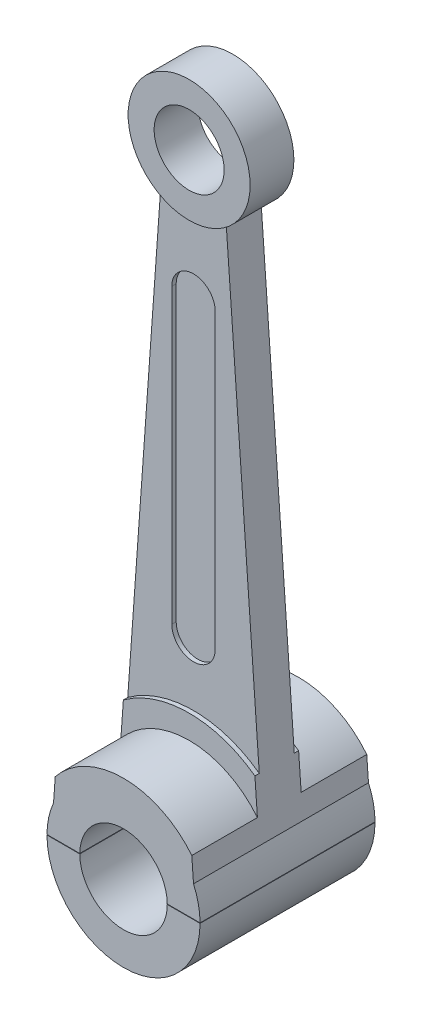
ISO-10303-21;
HEADER;
FILE_DESCRIPTION(('STEP AP214'),'2;1');
FILE_NAME('part.step','',(''),(''),'','','');
FILE_SCHEMA(('AUTOMOTIVE_DESIGN { 1 0 10303 214 1 1 1 1 }'));
ENDSEC;
DATA;
#1=APPLICATION_CONTEXT('core data for automotive mechanical design processes');
#2=APPLICATION_PROTOCOL_DEFINITION('international standard','automotive_design',2000,#1);
#3=PRODUCT_CONTEXT('',#1,'mechanical');
#4=PRODUCT('Part','Part','',(#3));
#5=PRODUCT_RELATED_PRODUCT_CATEGORY('part','',(#4));
#6=PRODUCT_DEFINITION_FORMATION('','',#4);
#7=PRODUCT_DEFINITION_CONTEXT('part definition',#1,'design');
#8=PRODUCT_DEFINITION('design','',#6,#7);
#9=PRODUCT_DEFINITION_SHAPE('','',#8);
#10=(LENGTH_UNIT() NAMED_UNIT(*) SI_UNIT(.MILLI.,.METRE.));
#11=(NAMED_UNIT(*) PLANE_ANGLE_UNIT() SI_UNIT($,.RADIAN.));
#12=(NAMED_UNIT(*) SI_UNIT($,.STERADIAN.) SOLID_ANGLE_UNIT());
#13=UNCERTAINTY_MEASURE_WITH_UNIT(LENGTH_MEASURE(1.E-05),#10,'distance_accuracy_value','');
#14=(GEOMETRIC_REPRESENTATION_CONTEXT(3) GLOBAL_UNCERTAINTY_ASSIGNED_CONTEXT((#13)) GLOBAL_UNIT_ASSIGNED_CONTEXT((#10,
#11,#12)) REPRESENTATION_CONTEXT('',''));
#15=CARTESIAN_POINT('',(0.,0.,0.));
#16=DIRECTION('',(0.,0.,1.));
#17=DIRECTION('',(1.,0.,0.));
#18=AXIS2_PLACEMENT_3D('',#15,#16,#17);
#19=CARTESIAN_POINT('',(0.,0.,-15.75));
#20=DIRECTION('',(0.,0.,1.));
#21=DIRECTION('',(1.,0.,0.));
#22=AXIS2_PLACEMENT_3D('',#19,#20,#21);
#23=CYLINDRICAL_SURFACE('',#22,1.75);
#24=CARTESIAN_POINT('',(0.,0.,-2.));
#25=DIRECTION('',(0.,0.,1.));
#26=DIRECTION('',(1.,0.,0.));
#27=AXIS2_PLACEMENT_3D('',#24,#25,#26);
#28=CIRCLE('',#27,1.75);
#29=CARTESIAN_POINT('',(-1.74997142833819,0.00999999999999898,-2.));
#30=VERTEX_POINT('',#29);
#31=CARTESIAN_POINT('',(-1.6,0.708872343937891,-2.));
#32=VERTEX_POINT('',#31);
#33=EDGE_CURVE('E264',#30,#32,#28,.F.);
#34=ORIENTED_EDGE('',*,*,#33,.F.);
#35=DIRECTION('',(0.,0.,1.));
#36=VECTOR('',#35,1.);
#37=CARTESIAN_POINT('',(-1.74997142833819,0.00999999999999898,-15.75));
#38=LINE('',#37,#36);
#39=CARTESIAN_POINT('',(-1.74997142833819,0.00999999999999898,2.));
#40=VERTEX_POINT('',#39);
#41=EDGE_CURVE('E299',#30,#40,#38,.T.);
#42=ORIENTED_EDGE('',*,*,#41,.T.);
#43=CARTESIAN_POINT('',(0.,0.,2.));
#44=DIRECTION('',(0.,0.,1.));
#45=DIRECTION('',(1.,0.,0.));
#46=AXIS2_PLACEMENT_3D('',#43,#44,#45);
#47=CIRCLE('',#46,1.75);
#48=CARTESIAN_POINT('',(-1.6,0.708872343937891,2.));
#49=VERTEX_POINT('',#48);
#50=EDGE_CURVE('E252',#40,#49,#47,.F.);
#51=ORIENTED_EDGE('',*,*,#50,.T.);
#52=DIRECTION('',(0.,0.,1.));
#53=VECTOR('',#52,1.);
#54=CARTESIAN_POINT('',(-1.6,0.708872343937891,-15.75));
#55=LINE('',#54,#53);
#56=EDGE_CURVE('E262',#32,#49,#55,.T.);
#57=ORIENTED_EDGE('',*,*,#56,.F.);
#58=EDGE_LOOP('',(#34,#42,#51,#57));
#59=FACE_BOUND('',#58,.T.);
#60=ADVANCED_FACE('F45',(#59),#23,.T.);
#61=CARTESIAN_POINT('',(0.,0.,0.5));
#62=DIRECTION('',(0.,0.,-1.));
#63=DIRECTION('',(-1.,0.,0.));
#64=AXIS2_PLACEMENT_3D('',#61,#62,#63);
#65=CYLINDRICAL_SURFACE('',#64,2.54);
#66=CARTESIAN_POINT('',(0.,0.,0.5));
#67=DIRECTION('',(0.,0.,1.));
#68=DIRECTION('',(1.,0.,0.));
#69=AXIS2_PLACEMENT_3D('',#66,#67,#68);
#70=CIRCLE('',#69,2.54);
#71=CARTESIAN_POINT('',(1.5036414370813,2.04711075144753,0.5));
#72=VERTEX_POINT('',#71);
#73=CARTESIAN_POINT('',(-1.5036414370813,2.04711075144753,0.5));
#74=VERTEX_POINT('',#73);
#75=EDGE_CURVE('E187',#72,#74,#70,.T.);
#76=ORIENTED_EDGE('',*,*,#75,.F.);
#77=DIRECTION('',(0.,0.,-1.));
#78=VECTOR('',#77,1.);
#79=CARTESIAN_POINT('',(1.5036414370813,2.04711075144753,0.5));
#80=LINE('',#79,#78);
#81=CARTESIAN_POINT('',(1.5036414370813,2.04711075144753,0.4));
#82=VERTEX_POINT('',#81);
#83=EDGE_CURVE('E249',#72,#82,#80,.T.);
#84=ORIENTED_EDGE('',*,*,#83,.T.);
#85=CARTESIAN_POINT('',(0.,0.,0.4));
#86=DIRECTION('',(0.,0.,1.));
#87=DIRECTION('',(1.,0.,0.));
#88=AXIS2_PLACEMENT_3D('',#85,#86,#87);
#89=CIRCLE('',#88,2.54);
#90=CARTESIAN_POINT('',(-1.5036414370813,2.04711075144753,0.4));
#91=VERTEX_POINT('',#90);
#92=EDGE_CURVE('E162',#82,#91,#89,.T.);
#93=ORIENTED_EDGE('',*,*,#92,.T.);
#94=DIRECTION('',(0.,0.,-1.));
#95=VECTOR('',#94,1.);
#96=CARTESIAN_POINT('',(-1.5036414370813,2.04711075144753,0.5));
#97=LINE('',#96,#95);
#98=EDGE_CURVE('E129',#91,#74,#97,.F.);
#99=ORIENTED_EDGE('',*,*,#98,.T.);
#100=EDGE_LOOP('',(#76,#84,#93,#99));
#101=FACE_BOUND('',#100,.T.);
#102=ADVANCED_FACE('F451',(#101),#65,.T.);
#103=CARTESIAN_POINT('',(0.,4.,0.4));
#104=DIRECTION('',(0.,0.,-1.));
#105=DIRECTION('',(-1.,0.,0.));
#106=AXIS2_PLACEMENT_3D('',#103,#104,#105);
#107=CYLINDRICAL_SURFACE('',#106,0.496250448401979);
#108=DIRECTION('',(0.,0.,-1.));
#109=VECTOR('',#108,1.);
#110=CARTESIAN_POINT('',(-0.496250448401978,4.,0.4));
#111=LINE('',#110,#109);
#112=CARTESIAN_POINT('',(-0.496250448401978,4.,-0.3));
#113=VERTEX_POINT('',#112);
#114=CARTESIAN_POINT('',(-0.496250448401978,4.,-0.4));
#115=VERTEX_POINT('',#114);
#116=EDGE_CURVE('E195',#113,#115,#111,.T.);
#117=ORIENTED_EDGE('',*,*,#116,.F.);
#118=CARTESIAN_POINT('',(0.,4.,-0.3));
#119=DIRECTION('',(0.,0.,1.));
#120=DIRECTION('',(1.,0.,0.));
#121=AXIS2_PLACEMENT_3D('',#118,#119,#120);
#122=CIRCLE('',#121,0.496250448401979);
#123=CARTESIAN_POINT('',(0.49625044840198,4.,-0.3));
#124=VERTEX_POINT('',#123);
#125=EDGE_CURVE('E201',#113,#124,#122,.T.);
#126=ORIENTED_EDGE('',*,*,#125,.T.);
#127=DIRECTION('',(0.,0.,-1.));
#128=VECTOR('',#127,1.);
#129=CARTESIAN_POINT('',(0.49625044840198,4.,0.4));
#130=LINE('',#129,#128);
#131=CARTESIAN_POINT('',(0.49625044840198,4.,-0.4));
#132=VERTEX_POINT('',#131);
#133=EDGE_CURVE('E204',#124,#132,#130,.T.);
#134=ORIENTED_EDGE('',*,*,#133,.T.);
#135=CARTESIAN_POINT('',(0.,4.,-0.4));
#136=DIRECTION('',(0.,0.,1.));
#137=DIRECTION('',(1.,0.,0.));
#138=AXIS2_PLACEMENT_3D('',#135,#136,#137);
#139=CIRCLE('',#138,0.496250448401979);
#140=EDGE_CURVE('E167',#115,#132,#139,.T.);
#141=ORIENTED_EDGE('',*,*,#140,.F.);
#142=EDGE_LOOP('',(#117,#126,#134,#141));
#143=FACE_BOUND('',#142,.T.);
#144=ADVANCED_FACE('F356',(#143),#107,.F.);
#145=CARTESIAN_POINT('',(-0.496250448401977,0.,0.4));
#146=DIRECTION('',(1.,0.,0.));
#147=DIRECTION('',(0.,1.,0.));
#148=AXIS2_PLACEMENT_3D('',#145,#146,#147);
#149=PLANE('',#148);
#150=DIRECTION('',(0.,0.,-1.));
#151=VECTOR('',#150,1.);
#152=CARTESIAN_POINT('',(-0.496250448401979,10.69,0.4));
#153=LINE('',#152,#151);
#154=CARTESIAN_POINT('',(-0.496250448401979,10.69,-0.3));
#155=VERTEX_POINT('',#154);
#156=CARTESIAN_POINT('',(-0.496250448401979,10.69,-0.4));
#157=VERTEX_POINT('',#156);
#158=EDGE_CURVE('E194',#155,#157,#153,.T.);
#159=ORIENTED_EDGE('',*,*,#158,.F.);
#160=DIRECTION('',(0.,-1.,0.));
#161=VECTOR('',#160,1.);
#162=CARTESIAN_POINT('',(-0.496250448401977,0.,-0.3));
#163=LINE('',#162,#161);
#164=EDGE_CURVE('E205',#155,#113,#163,.T.);
#165=ORIENTED_EDGE('',*,*,#164,.T.);
#166=ORIENTED_EDGE('',*,*,#116,.T.);
#167=DIRECTION('',(0.,-1.,0.));
#168=VECTOR('',#167,1.);
#169=CARTESIAN_POINT('',(-0.496250448401977,0.,-0.4));
#170=LINE('',#169,#168);
#171=EDGE_CURVE('E333',#157,#115,#170,.T.);
#172=ORIENTED_EDGE('',*,*,#171,.F.);
#173=EDGE_LOOP('',(#159,#165,#166,#172));
#174=FACE_BOUND('',#173,.T.);
#175=ADVANCED_FACE('F458',(#174),#149,.T.);
#176=CARTESIAN_POINT('',(0.,10.69,0.4));
#177=DIRECTION('',(0.,0.,-1.));
#178=DIRECTION('',(-1.,0.,0.));
#179=AXIS2_PLACEMENT_3D('',#176,#177,#178);
#180=CYLINDRICAL_SURFACE('',#179,0.496250448401979);
#181=DIRECTION('',(0.,0.,-1.));
#182=VECTOR('',#181,1.);
#183=CARTESIAN_POINT('',(0.496250448401979,10.69,0.4));
#184=LINE('',#183,#182);
#185=CARTESIAN_POINT('',(0.496250448401979,10.69,-0.3));
#186=VERTEX_POINT('',#185);
#187=CARTESIAN_POINT('',(0.496250448401979,10.69,-0.4));
#188=VERTEX_POINT('',#187);
#189=EDGE_CURVE('E327',#186,#188,#184,.T.);
#190=ORIENTED_EDGE('',*,*,#189,.F.);
#191=CARTESIAN_POINT('',(0.,10.69,-0.3));
#192=DIRECTION('',(0.,0.,1.));
#193=DIRECTION('',(1.,0.,0.));
#194=AXIS2_PLACEMENT_3D('',#191,#192,#193);
#195=CIRCLE('',#194,0.496250448401979);
#196=EDGE_CURVE('E191',#186,#155,#195,.T.);
#197=ORIENTED_EDGE('',*,*,#196,.T.);
#198=ORIENTED_EDGE('',*,*,#158,.T.);
#199=CARTESIAN_POINT('',(0.,10.69,-0.4));
#200=DIRECTION('',(0.,0.,1.));
#201=DIRECTION('',(1.,0.,0.));
#202=AXIS2_PLACEMENT_3D('',#199,#200,#201);
#203=CIRCLE('',#202,0.496250448401979);
#204=EDGE_CURVE('E336',#188,#157,#203,.T.);
#205=ORIENTED_EDGE('',*,*,#204,.F.);
#206=EDGE_LOOP('',(#190,#197,#198,#205));
#207=FACE_BOUND('',#206,.T.);
#208=ADVANCED_FACE('F485',(#207),#180,.F.);
#209=CARTESIAN_POINT('',(0.49625044840198,0.,0.4));
#210=DIRECTION('',(1.,0.,0.));
#211=DIRECTION('',(0.,1.,0.));
#212=AXIS2_PLACEMENT_3D('',#209,#210,#211);
#213=PLANE('',#212);
#214=DIRECTION('',(0.,-1.,0.));
#215=VECTOR('',#214,1.);
#216=CARTESIAN_POINT('',(0.49625044840198,0.,-0.3));
#217=LINE('',#216,#215);
#218=EDGE_CURVE('E196',#186,#124,#217,.T.);
#219=ORIENTED_EDGE('',*,*,#218,.F.);
#220=ORIENTED_EDGE('',*,*,#189,.T.);
#221=DIRECTION('',(0.,-1.,0.));
#222=VECTOR('',#221,1.);
#223=CARTESIAN_POINT('',(0.49625044840198,0.,-0.4));
#224=LINE('',#223,#222);
#225=EDGE_CURVE('E158',#188,#132,#224,.T.);
#226=ORIENTED_EDGE('',*,*,#225,.T.);
#227=ORIENTED_EDGE('',*,*,#133,.F.);
#228=EDGE_LOOP('',(#219,#220,#226,#227));
#229=FACE_BOUND('',#228,.T.);
#230=ADVANCED_FACE('F480',(#229),#213,.F.);
#231=CARTESIAN_POINT('',(0.,13.69,0.5));
#232=DIRECTION('',(0.,0.,-1.));
#233=DIRECTION('',(-1.,0.,0.));
#234=AXIS2_PLACEMENT_3D('',#231,#232,#233);
#235=CYLINDRICAL_SURFACE('',#234,0.8);
#236=CARTESIAN_POINT('',(0.,13.69,0.5));
#237=DIRECTION('',(0.,0.,1.));
#238=DIRECTION('',(1.,0.,0.));
#239=AXIS2_PLACEMENT_3D('',#236,#237,#238);
#240=CIRCLE('',#239,0.8);
#241=CARTESIAN_POINT('',(0.8,13.69,0.5));
#242=VERTEX_POINT('',#241);
#243=EDGE_CURVE('E153',#242,#242,#240,.T.);
#244=ORIENTED_EDGE('',*,*,#243,.T.);
#245=EDGE_LOOP('',(#244));
#246=FACE_BOUND('',#245,.T.);
#247=CARTESIAN_POINT('',(0.,13.69,-0.5));
#248=DIRECTION('',(0.,0.,1.));
#249=DIRECTION('',(1.,0.,0.));
#250=AXIS2_PLACEMENT_3D('',#247,#248,#249);
#251=CIRCLE('',#250,0.8);
#252=CARTESIAN_POINT('',(0.8,13.69,-0.5));
#253=VERTEX_POINT('',#252);
#254=EDGE_CURVE('E181',#253,#253,#251,.T.);
#255=ORIENTED_EDGE('',*,*,#254,.F.);
#256=EDGE_LOOP('',(#255));
#257=FACE_BOUND('',#256,.T.);
#258=ADVANCED_FACE('F501',(#246,#257),#235,.F.);
#259=CARTESIAN_POINT('',(0.,13.69,0.5));
#260=DIRECTION('',(0.,0.,-1.));
#261=DIRECTION('',(-1.,0.,0.));
#262=AXIS2_PLACEMENT_3D('',#259,#260,#261);
#263=CYLINDRICAL_SURFACE('',#262,1.395);
#264=CARTESIAN_POINT('',(0.,13.69,0.4));
#265=DIRECTION('',(0.,0.,1.));
#266=DIRECTION('',(1.,0.,0.));
#267=AXIS2_PLACEMENT_3D('',#264,#265,#266);
#268=CIRCLE('',#267,1.395);
#269=CARTESIAN_POINT('',(-0.75,12.5137666047931,0.400000000000001));
#270=VERTEX_POINT('',#269);
#271=CARTESIAN_POINT('',(0.75,12.5137666047931,0.400000000000001));
#272=VERTEX_POINT('',#271);
#273=EDGE_CURVE('E143',#270,#272,#268,.T.);
#274=ORIENTED_EDGE('',*,*,#273,.T.);
#275=DIRECTION('',(0.,0.,-1.));
#276=VECTOR('',#275,1.);
#277=CARTESIAN_POINT('',(0.75,12.5137666047931,0.4));
#278=LINE('',#277,#276);
#279=CARTESIAN_POINT('',(0.75,12.5137666047931,-0.399999999999999));
#280=VERTEX_POINT('',#279);
#281=EDGE_CURVE('E152',#272,#280,#278,.T.);
#282=ORIENTED_EDGE('',*,*,#281,.T.);
#283=CARTESIAN_POINT('',(0.,13.69,-0.4));
#284=DIRECTION('',(0.,0.,1.));
#285=DIRECTION('',(1.,0.,0.));
#286=AXIS2_PLACEMENT_3D('',#283,#284,#285);
#287=CIRCLE('',#286,1.395);
#288=CARTESIAN_POINT('',(-0.75,12.5137666047931,-0.399999999999999));
#289=VERTEX_POINT('',#288);
#290=EDGE_CURVE('E145',#289,#280,#287,.T.);
#291=ORIENTED_EDGE('',*,*,#290,.F.);
#292=DIRECTION('',(0.,0.,-1.));
#293=VECTOR('',#292,1.);
#294=CARTESIAN_POINT('',(-0.75,12.5137666047931,0.4));
#295=LINE('',#294,#293);
#296=EDGE_CURVE('E127',#270,#289,#295,.T.);
#297=ORIENTED_EDGE('',*,*,#296,.F.);
#298=EDGE_LOOP('',(#274,#282,#291,#297));
#299=FACE_BOUND('',#298,.T.);
#300=CARTESIAN_POINT('',(0.,13.69,-0.5));
#301=DIRECTION('',(0.,0.,1.));
#302=DIRECTION('',(1.,0.,0.));
#303=AXIS2_PLACEMENT_3D('',#300,#301,#302);
#304=CIRCLE('',#303,1.395);
#305=CARTESIAN_POINT('',(1.395,13.69,-0.5));
#306=VERTEX_POINT('',#305);
#307=EDGE_CURVE('E155',#306,#306,#304,.T.);
#308=ORIENTED_EDGE('',*,*,#307,.T.);
#309=EDGE_LOOP('',(#308));
#310=FACE_BOUND('',#309,.T.);
#311=CARTESIAN_POINT('',(0.,13.69,0.5));
#312=DIRECTION('',(0.,0.,1.));
#313=DIRECTION('',(1.,0.,0.));
#314=AXIS2_PLACEMENT_3D('',#311,#312,#313);
#315=CIRCLE('',#314,1.395);
#316=CARTESIAN_POINT('',(1.395,13.69,0.5));
#317=VERTEX_POINT('',#316);
#318=EDGE_CURVE('E316',#317,#317,#315,.T.);
#319=ORIENTED_EDGE('',*,*,#318,.F.);
#320=EDGE_LOOP('',(#319));
#321=FACE_BOUND('',#320,.T.);
#322=ADVANCED_FACE('F139',(#299,#310,#321),#263,.T.);
#323=CARTESIAN_POINT('',(0.,0.,0.5));
#324=DIRECTION('',(0.,0.,1.));
#325=DIRECTION('',(1.,0.,0.));
#326=AXIS2_PLACEMENT_3D('',#323,#324,#325);
#327=PLANE('',#326);
#328=ORIENTED_EDGE('',*,*,#243,.F.);
#329=EDGE_LOOP('',(#328));
#330=FACE_BOUND('',#329,.T.);
#331=ORIENTED_EDGE('',*,*,#318,.T.);
#332=EDGE_LOOP('',(#331));
#333=FACE_BOUND('',#332,.T.);
#334=ADVANCED_FACE('F492',(#330,#333),#327,.T.);
#335=CARTESIAN_POINT('',(0.,0.,-0.5));
#336=DIRECTION('',(0.,0.,1.));
#337=DIRECTION('',(1.,0.,0.));
#338=AXIS2_PLACEMENT_3D('',#335,#336,#337);
#339=PLANE('',#338);
#340=ORIENTED_EDGE('',*,*,#254,.T.);
#341=EDGE_LOOP('',(#340));
#342=FACE_BOUND('',#341,.T.);
#343=ORIENTED_EDGE('',*,*,#307,.F.);
#344=EDGE_LOOP('',(#343));
#345=FACE_BOUND('',#344,.T.);
#346=ADVANCED_FACE('F490',(#342,#345),#339,.F.);
#347=CARTESIAN_POINT('',(0.,4.,0.3));
#348=DIRECTION('',(0.,0.,1.));
#349=DIRECTION('',(1.,0.,0.));
#350=AXIS2_PLACEMENT_3D('',#347,#348,#349);
#351=CIRCLE('',#350,0.496250448401979);
#352=CARTESIAN_POINT('',(-0.496250448401978,4.,0.3));
#353=VERTEX_POINT('',#352);
#354=CARTESIAN_POINT('',(0.49625044840198,4.,0.3));
#355=VERTEX_POINT('',#354);
#356=EDGE_CURVE('E212',#353,#355,#351,.T.);
#357=ORIENTED_EDGE('',*,*,#356,.F.);
#358=CARTESIAN_POINT('',(-0.496250448401978,4.,0.4));
#359=VERTEX_POINT('',#358);
#360=EDGE_CURVE('E173',#359,#353,#111,.T.);
#361=ORIENTED_EDGE('',*,*,#360,.F.);
#362=CARTESIAN_POINT('',(0.,4.,0.4));
#363=DIRECTION('',(0.,0.,1.));
#364=DIRECTION('',(1.,0.,0.));
#365=AXIS2_PLACEMENT_3D('',#362,#363,#364);
#366=CIRCLE('',#365,0.496250448401979);
#367=CARTESIAN_POINT('',(0.49625044840198,4.,0.4));
#368=VERTEX_POINT('',#367);
#369=EDGE_CURVE('E178',#359,#368,#366,.T.);
#370=ORIENTED_EDGE('',*,*,#369,.T.);
#371=EDGE_CURVE('E177',#368,#355,#130,.T.);
#372=ORIENTED_EDGE('',*,*,#371,.T.);
#373=EDGE_LOOP('',(#357,#361,#370,#372));
#374=FACE_BOUND('',#373,.T.);
#375=ADVANCED_FACE('F460',(#374),#107,.F.);
#376=DIRECTION('',(0.,-1.,0.));
#377=VECTOR('',#376,1.);
#378=CARTESIAN_POINT('',(-0.496250448401977,0.,0.3));
#379=LINE('',#378,#377);
#380=CARTESIAN_POINT('',(-0.496250448401979,10.69,0.3));
#381=VERTEX_POINT('',#380);
#382=EDGE_CURVE('E199',#381,#353,#379,.T.);
#383=ORIENTED_EDGE('',*,*,#382,.F.);
#384=CARTESIAN_POINT('',(-0.496250448401979,10.69,0.4));
#385=VERTEX_POINT('',#384);
#386=EDGE_CURVE('E172',#385,#381,#153,.T.);
#387=ORIENTED_EDGE('',*,*,#386,.F.);
#388=DIRECTION('',(0.,-1.,0.));
#389=VECTOR('',#388,1.);
#390=CARTESIAN_POINT('',(-0.496250448401977,0.,0.4));
#391=LINE('',#390,#389);
#392=EDGE_CURVE('E174',#385,#359,#391,.T.);
#393=ORIENTED_EDGE('',*,*,#392,.T.);
#394=ORIENTED_EDGE('',*,*,#360,.T.);
#395=EDGE_LOOP('',(#383,#387,#393,#394));
#396=FACE_BOUND('',#395,.T.);
#397=ADVANCED_FACE('F483',(#396),#149,.T.);
#398=CARTESIAN_POINT('',(0.,10.69,0.3));
#399=DIRECTION('',(0.,0.,1.));
#400=DIRECTION('',(1.,0.,0.));
#401=AXIS2_PLACEMENT_3D('',#398,#399,#400);
#402=CIRCLE('',#401,0.496250448401979);
#403=CARTESIAN_POINT('',(0.496250448401979,10.69,0.3));
#404=VERTEX_POINT('',#403);
#405=EDGE_CURVE('E208',#404,#381,#402,.T.);
#406=ORIENTED_EDGE('',*,*,#405,.F.);
#407=CARTESIAN_POINT('',(0.496250448401979,10.69,0.4));
#408=VERTEX_POINT('',#407);
#409=EDGE_CURVE('E215',#408,#404,#184,.T.);
#410=ORIENTED_EDGE('',*,*,#409,.F.);
#411=CARTESIAN_POINT('',(0.,10.69,0.4));
#412=DIRECTION('',(0.,0.,1.));
#413=DIRECTION('',(1.,0.,0.));
#414=AXIS2_PLACEMENT_3D('',#411,#412,#413);
#415=CIRCLE('',#414,0.496250448401979);
#416=EDGE_CURVE('E169',#408,#385,#415,.T.);
#417=ORIENTED_EDGE('',*,*,#416,.T.);
#418=ORIENTED_EDGE('',*,*,#386,.T.);
#419=EDGE_LOOP('',(#406,#410,#417,#418));
#420=FACE_BOUND('',#419,.T.);
#421=ADVANCED_FACE('F478',(#420),#180,.F.);
#422=ORIENTED_EDGE('',*,*,#409,.T.);
#423=DIRECTION('',(0.,-1.,0.));
#424=VECTOR('',#423,1.);
#425=CARTESIAN_POINT('',(0.49625044840198,0.,0.3));
#426=LINE('',#425,#424);
#427=EDGE_CURVE('E168',#404,#355,#426,.T.);
#428=ORIENTED_EDGE('',*,*,#427,.T.);
#429=ORIENTED_EDGE('',*,*,#371,.F.);
#430=DIRECTION('',(0.,-1.,0.));
#431=VECTOR('',#430,1.);
#432=CARTESIAN_POINT('',(0.49625044840198,0.,0.4));
#433=LINE('',#432,#431);
#434=EDGE_CURVE('E164',#408,#368,#433,.T.);
#435=ORIENTED_EDGE('',*,*,#434,.F.);
#436=EDGE_LOOP('',(#422,#428,#429,#435));
#437=FACE_BOUND('',#436,.T.);
#438=ADVANCED_FACE('F474',(#437),#213,.F.);
#439=CARTESIAN_POINT('',(0.,0.,0.4));
#440=DIRECTION('',(0.,0.,1.));
#441=DIRECTION('',(1.,0.,0.));
#442=AXIS2_PLACEMENT_3D('',#439,#440,#441);
#443=PLANE('',#442);
#444=DIRECTION('',(0.0718181006562887,-0.997417746191696,0.));
#445=VECTOR('',#444,1.);
#446=CARTESIAN_POINT('',(1.64252585982471,0.118268486781843,0.4));
#447=LINE('',#446,#445);
#448=EDGE_CURVE('E151',#272,#82,#447,.T.);
#449=ORIENTED_EDGE('',*,*,#448,.F.);
#450=ORIENTED_EDGE('',*,*,#273,.F.);
#451=DIRECTION('',(0.0718181006562887,0.997417746191696,0.));
#452=VECTOR('',#451,1.);
#453=CARTESIAN_POINT('',(-1.64252585982471,0.118268486781843,0.4));
#454=LINE('',#453,#452);
#455=EDGE_CURVE('E124',#91,#270,#454,.T.);
#456=ORIENTED_EDGE('',*,*,#455,.F.);
#457=ORIENTED_EDGE('',*,*,#92,.F.);
#458=EDGE_LOOP('',(#449,#450,#456,#457));
#459=FACE_BOUND('',#458,.T.);
#460=ORIENTED_EDGE('',*,*,#369,.F.);
#461=ORIENTED_EDGE('',*,*,#392,.F.);
#462=ORIENTED_EDGE('',*,*,#416,.F.);
#463=ORIENTED_EDGE('',*,*,#434,.T.);
#464=EDGE_LOOP('',(#460,#461,#462,#463));
#465=FACE_BOUND('',#464,.T.);
#466=ADVANCED_FACE('F148',(#459,#465),#443,.T.);
#467=CARTESIAN_POINT('',(0.,0.,-0.4));
#468=DIRECTION('',(0.,0.,1.));
#469=DIRECTION('',(1.,0.,0.));
#470=AXIS2_PLACEMENT_3D('',#467,#468,#469);
#471=PLANE('',#470);
#472=ORIENTED_EDGE('',*,*,#140,.T.);
#473=ORIENTED_EDGE('',*,*,#225,.F.);
#474=ORIENTED_EDGE('',*,*,#204,.T.);
#475=ORIENTED_EDGE('',*,*,#171,.T.);
#476=EDGE_LOOP('',(#472,#473,#474,#475));
#477=FACE_BOUND('',#476,.T.);
#478=ORIENTED_EDGE('',*,*,#290,.T.);
#479=DIRECTION('',(0.0718181006562887,-0.997417746191696,0.));
#480=VECTOR('',#479,1.);
#481=CARTESIAN_POINT('',(1.64252585982471,0.118268486781843,-0.4));
#482=LINE('',#481,#480);
#483=CARTESIAN_POINT('',(1.5036414370813,2.04711075144753,-0.4));
#484=VERTEX_POINT('',#483);
#485=EDGE_CURVE('E230',#280,#484,#482,.T.);
#486=ORIENTED_EDGE('',*,*,#485,.T.);
#487=CARTESIAN_POINT('',(0.,0.,-0.4));
#488=DIRECTION('',(0.,0.,1.));
#489=DIRECTION('',(1.,0.,0.));
#490=AXIS2_PLACEMENT_3D('',#487,#488,#489);
#491=CIRCLE('',#490,2.54);
#492=CARTESIAN_POINT('',(-1.5036414370813,2.04711075144753,-0.4));
#493=VERTEX_POINT('',#492);
#494=EDGE_CURVE('E233',#484,#493,#491,.T.);
#495=ORIENTED_EDGE('',*,*,#494,.T.);
#496=DIRECTION('',(0.0718181006562887,0.997417746191696,0.));
#497=VECTOR('',#496,1.);
#498=CARTESIAN_POINT('',(-1.64252585982471,0.118268486781843,-0.4));
#499=LINE('',#498,#497);
#500=EDGE_CURVE('E95',#493,#289,#499,.T.);
#501=ORIENTED_EDGE('',*,*,#500,.T.);
#502=EDGE_LOOP('',(#478,#486,#495,#501));
#503=FACE_BOUND('',#502,.T.);
#504=ADVANCED_FACE('F345',(#477,#503),#471,.F.);
#505=ORIENTED_EDGE('',*,*,#494,.F.);
#506=CARTESIAN_POINT('',(1.5036414370813,2.04711075144753,-0.5));
#507=VERTEX_POINT('',#506);
#508=EDGE_CURVE('E186',#484,#507,#80,.T.);
#509=ORIENTED_EDGE('',*,*,#508,.T.);
#510=CARTESIAN_POINT('',(0.,0.,-0.5));
#511=DIRECTION('',(0.,0.,1.));
#512=DIRECTION('',(1.,0.,0.));
#513=AXIS2_PLACEMENT_3D('',#510,#511,#512);
#514=CIRCLE('',#513,2.54);
#515=CARTESIAN_POINT('',(-1.5036414370813,2.04711075144753,-0.5));
#516=VERTEX_POINT('',#515);
#517=EDGE_CURVE('E182',#507,#516,#514,.T.);
#518=ORIENTED_EDGE('',*,*,#517,.T.);
#519=EDGE_CURVE('E185',#516,#493,#97,.F.);
#520=ORIENTED_EDGE('',*,*,#519,.T.);
#521=EDGE_LOOP('',(#505,#509,#518,#520));
#522=FACE_BOUND('',#521,.T.);
#523=ADVANCED_FACE('F421',(#522),#65,.T.);
#524=CARTESIAN_POINT('',(0.,0.,0.5));
#525=DIRECTION('',(0.,0.,1.));
#526=DIRECTION('',(1.,0.,0.));
#527=AXIS2_PLACEMENT_3D('',#524,#525,#526);
#528=PLANE('',#527);
#529=DIRECTION('',(0.0718181006562887,-0.997417746191696,0.));
#530=VECTOR('',#529,1.);
#531=CARTESIAN_POINT('',(1.64252585982471,0.118268486781843,0.5));
#532=LINE('',#531,#530);
#533=CARTESIAN_POINT('',(1.56101559444764,1.25029209142955,0.5));
#534=VERTEX_POINT('',#533);
#535=EDGE_CURVE('E247',#72,#534,#532,.T.);
#536=ORIENTED_EDGE('',*,*,#535,.F.);
#537=ORIENTED_EDGE('',*,*,#75,.T.);
#538=DIRECTION('',(0.0718181006562887,0.997417746191696,0.));
#539=VECTOR('',#538,1.);
#540=CARTESIAN_POINT('',(-1.64252585982471,0.118268486781843,0.5));
#541=LINE('',#540,#539);
#542=CARTESIAN_POINT('',(-1.56101559444764,1.25029209142955,0.5));
#543=VERTEX_POINT('',#542);
#544=EDGE_CURVE('E134',#543,#74,#541,.T.);
#545=ORIENTED_EDGE('',*,*,#544,.F.);
#546=CARTESIAN_POINT('',(0.,0.,0.5));
#547=DIRECTION('',(0.,0.,1.));
#548=DIRECTION('',(1.,0.,0.));
#549=AXIS2_PLACEMENT_3D('',#546,#547,#548);
#550=CIRCLE('',#549,2.);
#551=EDGE_CURVE('E220',#534,#543,#550,.T.);
#552=ORIENTED_EDGE('',*,*,#551,.F.);
#553=EDGE_LOOP('',(#536,#537,#545,#552));
#554=FACE_BOUND('',#553,.T.);
#555=ADVANCED_FACE('F448',(#554),#528,.T.);
#556=CARTESIAN_POINT('',(0.,0.,-0.5));
#557=DIRECTION('',(0.,0.,1.));
#558=DIRECTION('',(1.,0.,0.));
#559=AXIS2_PLACEMENT_3D('',#556,#557,#558);
#560=PLANE('',#559);
#561=ORIENTED_EDGE('',*,*,#517,.F.);
#562=DIRECTION('',(0.0718181006562887,-0.997417746191696,0.));
#563=VECTOR('',#562,1.);
#564=CARTESIAN_POINT('',(1.64252585982471,0.118268486781843,-0.5));
#565=LINE('',#564,#563);
#566=CARTESIAN_POINT('',(1.56101559444764,1.25029209142955,-0.5));
#567=VERTEX_POINT('',#566);
#568=EDGE_CURVE('E190',#507,#567,#565,.T.);
#569=ORIENTED_EDGE('',*,*,#568,.T.);
#570=CARTESIAN_POINT('',(0.,0.,-0.5));
#571=DIRECTION('',(0.,0.,1.));
#572=DIRECTION('',(1.,0.,0.));
#573=AXIS2_PLACEMENT_3D('',#570,#571,#572);
#574=CIRCLE('',#573,2.);
#575=CARTESIAN_POINT('',(-1.56101559444764,1.25029209142955,-0.5));
#576=VERTEX_POINT('',#575);
#577=EDGE_CURVE('E236',#567,#576,#574,.T.);
#578=ORIENTED_EDGE('',*,*,#577,.T.);
#579=DIRECTION('',(0.0718181006562887,0.997417746191696,0.));
#580=VECTOR('',#579,1.);
#581=CARTESIAN_POINT('',(-1.64252585982471,0.118268486781843,-0.5));
#582=LINE('',#581,#580);
#583=EDGE_CURVE('E200',#576,#516,#582,.T.);
#584=ORIENTED_EDGE('',*,*,#583,.T.);
#585=EDGE_LOOP('',(#561,#569,#578,#584));
#586=FACE_BOUND('',#585,.T.);
#587=ADVANCED_FACE('F425',(#586),#560,.F.);
#588=CARTESIAN_POINT('',(0.,0.,-0.3));
#589=DIRECTION('',(0.,0.,1.));
#590=DIRECTION('',(1.,0.,0.));
#591=AXIS2_PLACEMENT_3D('',#588,#589,#590);
#592=PLANE('',#591);
#593=ORIENTED_EDGE('',*,*,#164,.F.);
#594=ORIENTED_EDGE('',*,*,#196,.F.);
#595=ORIENTED_EDGE('',*,*,#218,.T.);
#596=ORIENTED_EDGE('',*,*,#125,.F.);
#597=EDGE_LOOP('',(#593,#594,#595,#596));
#598=FACE_BOUND('',#597,.T.);
#599=ADVANCED_FACE('F530',(#598),#592,.F.);
#600=CARTESIAN_POINT('',(0.,0.,0.3));
#601=DIRECTION('',(0.,0.,1.));
#602=DIRECTION('',(1.,0.,0.));
#603=AXIS2_PLACEMENT_3D('',#600,#601,#602);
#604=PLANE('',#603);
#605=ORIENTED_EDGE('',*,*,#382,.T.);
#606=ORIENTED_EDGE('',*,*,#356,.T.);
#607=ORIENTED_EDGE('',*,*,#427,.F.);
#608=ORIENTED_EDGE('',*,*,#405,.T.);
#609=EDGE_LOOP('',(#605,#606,#607,#608));
#610=FACE_BOUND('',#609,.T.);
#611=ADVANCED_FACE('F626',(#610),#604,.T.);
#612=CARTESIAN_POINT('',(0.,0.,-2.));
#613=DIRECTION('',(0.,0.,1.));
#614=DIRECTION('',(1.,0.,0.));
#615=AXIS2_PLACEMENT_3D('',#612,#613,#614);
#616=CYLINDRICAL_SURFACE('',#615,2.);
#617=DIRECTION('',(0.,0.,1.));
#618=VECTOR('',#617,1.);
#619=CARTESIAN_POINT('',(1.56101559444764,1.25029209142955,-2.));
#620=LINE('',#619,#618);
#621=CARTESIAN_POINT('',(1.56101559444764,1.25029209142955,-2.));
#622=VERTEX_POINT('',#621);
#623=EDGE_CURVE('E237',#622,#567,#620,.T.);
#624=ORIENTED_EDGE('',*,*,#623,.F.);
#625=CARTESIAN_POINT('',(0.,0.,-2.));
#626=DIRECTION('',(0.,0.,1.));
#627=DIRECTION('',(1.,0.,0.));
#628=AXIS2_PLACEMENT_3D('',#625,#626,#627);
#629=CIRCLE('',#628,2.);
#630=CARTESIAN_POINT('',(-1.56101559444764,1.25029209142955,-2.));
#631=VERTEX_POINT('',#630);
#632=EDGE_CURVE('E211',#622,#631,#629,.T.);
#633=ORIENTED_EDGE('',*,*,#632,.T.);
#634=DIRECTION('',(0.,0.,1.));
#635=VECTOR('',#634,1.);
#636=CARTESIAN_POINT('',(-1.56101559444764,1.25029209142955,-2.));
#637=LINE('',#636,#635);
#638=EDGE_CURVE('E240',#576,#631,#637,.F.);
#639=ORIENTED_EDGE('',*,*,#638,.F.);
#640=ORIENTED_EDGE('',*,*,#577,.F.);
#641=EDGE_LOOP('',(#624,#633,#639,#640));
#642=FACE_BOUND('',#641,.T.);
#643=ADVANCED_FACE('F429',(#642),#616,.T.);
#644=CARTESIAN_POINT('',(0.,0.,-2.));
#645=DIRECTION('',(0.,0.,1.));
#646=DIRECTION('',(1.,0.,0.));
#647=AXIS2_PLACEMENT_3D('',#644,#645,#646);
#648=PLANE('',#647);
#649=CARTESIAN_POINT('',(1.6,0.708872343937891,-2.));
#650=VERTEX_POINT('',#649);
#651=CARTESIAN_POINT('',(1.74997142833819,0.00999999999999939,-2.));
#652=VERTEX_POINT('',#651);
#653=EDGE_CURVE('E49',#650,#652,#28,.F.);
#654=ORIENTED_EDGE('',*,*,#653,.T.);
#655=DIRECTION('',(-1.,0.,0.));
#656=VECTOR('',#655,1.);
#657=CARTESIAN_POINT('',(0.,0.00999999999999919,-2.));
#658=LINE('',#657,#656);
#659=CARTESIAN_POINT('',(0.999949998749938,0.0099999999999993,-2.));
#660=VERTEX_POINT('',#659);
#661=EDGE_CURVE('E277',#652,#660,#658,.T.);
#662=ORIENTED_EDGE('',*,*,#661,.T.);
#663=CARTESIAN_POINT('',(0.,0.,-2.));
#664=DIRECTION('',(0.,0.,1.));
#665=DIRECTION('',(1.,0.,0.));
#666=AXIS2_PLACEMENT_3D('',#663,#664,#665);
#667=CIRCLE('',#666,1.);
#668=CARTESIAN_POINT('',(-0.999949998749938,0.00999999999999907,-2.));
#669=VERTEX_POINT('',#668);
#670=EDGE_CURVE('E280',#660,#669,#667,.T.);
#671=ORIENTED_EDGE('',*,*,#670,.T.);
#672=EDGE_CURVE('E65',#669,#30,#658,.T.);
#673=ORIENTED_EDGE('',*,*,#672,.T.);
#674=ORIENTED_EDGE('',*,*,#33,.T.);
#675=DIRECTION('',(0.0718181006562887,0.997417746191696,0.));
#676=VECTOR('',#675,1.);
#677=CARTESIAN_POINT('',(-1.64252585982471,0.118268486781843,-2.));
#678=LINE('',#677,#676);
#679=EDGE_CURVE('E245',#32,#631,#678,.T.);
#680=ORIENTED_EDGE('',*,*,#679,.T.);
#681=ORIENTED_EDGE('',*,*,#632,.F.);
#682=DIRECTION('',(0.0718181006562887,-0.997417746191696,0.));
#683=VECTOR('',#682,1.);
#684=CARTESIAN_POINT('',(1.64252585982471,0.118268486781843,-2.));
#685=LINE('',#684,#683);
#686=EDGE_CURVE('E242',#622,#650,#685,.T.);
#687=ORIENTED_EDGE('',*,*,#686,.T.);
#688=EDGE_LOOP('',(#654,#662,#671,#673,#674,#680,#681,#687));
#689=FACE_BOUND('',#688,.T.);
#690=ADVANCED_FACE('F47',(#689),#648,.F.);
#691=CARTESIAN_POINT('',(0.,0.,0.5));
#692=DIRECTION('',(0.,0.,-1.));
#693=DIRECTION('',(-1.,0.,0.));
#694=AXIS2_PLACEMENT_3D('',#691,#692,#693);
#695=CYLINDRICAL_SURFACE('',#694,1.);
#696=DIRECTION('',(0.,0.,-1.));
#697=VECTOR('',#696,1.);
#698=CARTESIAN_POINT('',(0.999949998749938,0.0099999999999993,0.5));
#699=LINE('',#698,#697);
#700=CARTESIAN_POINT('',(0.999949998749938,0.0099999999999993,2.));
#701=VERTEX_POINT('',#700);
#702=EDGE_CURVE('E276',#701,#660,#699,.T.);
#703=ORIENTED_EDGE('',*,*,#702,.F.);
#704=CARTESIAN_POINT('',(0.,0.,2.));
#705=DIRECTION('',(0.,0.,1.));
#706=DIRECTION('',(1.,0.,0.));
#707=AXIS2_PLACEMENT_3D('',#704,#705,#706);
#708=CIRCLE('',#707,1.);
#709=CARTESIAN_POINT('',(-0.999949998749938,0.00999999999999907,2.));
#710=VERTEX_POINT('',#709);
#711=EDGE_CURVE('E224',#701,#710,#708,.T.);
#712=ORIENTED_EDGE('',*,*,#711,.T.);
#713=DIRECTION('',(0.,0.,-1.));
#714=VECTOR('',#713,1.);
#715=CARTESIAN_POINT('',(-0.999949998749938,0.00999999999999907,0.5));
#716=LINE('',#715,#714);
#717=EDGE_CURVE('E55',#669,#710,#716,.F.);
#718=ORIENTED_EDGE('',*,*,#717,.F.);
#719=ORIENTED_EDGE('',*,*,#670,.F.);
#720=EDGE_LOOP('',(#703,#712,#718,#719));
#721=FACE_BOUND('',#720,.T.);
#722=ADVANCED_FACE('F288',(#721),#695,.F.);
#723=DIRECTION('',(0.,0.,1.));
#724=VECTOR('',#723,1.);
#725=CARTESIAN_POINT('',(1.56101559444764,1.25029209142955,-2.));
#726=LINE('',#725,#724);
#727=CARTESIAN_POINT('',(1.56101559444764,1.25029209142955,2.));
#728=VERTEX_POINT('',#727);
#729=EDGE_CURVE('E255',#534,#728,#726,.T.);
#730=ORIENTED_EDGE('',*,*,#729,.F.);
#731=ORIENTED_EDGE('',*,*,#551,.T.);
#732=DIRECTION('',(0.,0.,1.));
#733=VECTOR('',#732,1.);
#734=CARTESIAN_POINT('',(-1.56101559444764,1.25029209142955,-2.));
#735=LINE('',#734,#733);
#736=CARTESIAN_POINT('',(-1.56101559444764,1.25029209142955,2.));
#737=VERTEX_POINT('',#736);
#738=EDGE_CURVE('E268',#737,#543,#735,.F.);
#739=ORIENTED_EDGE('',*,*,#738,.F.);
#740=CARTESIAN_POINT('',(0.,0.,2.));
#741=DIRECTION('',(0.,0.,1.));
#742=DIRECTION('',(1.,0.,0.));
#743=AXIS2_PLACEMENT_3D('',#740,#741,#742);
#744=CIRCLE('',#743,2.);
#745=EDGE_CURVE('E223',#728,#737,#744,.T.);
#746=ORIENTED_EDGE('',*,*,#745,.F.);
#747=EDGE_LOOP('',(#730,#731,#739,#746));
#748=FACE_BOUND('',#747,.T.);
#749=ADVANCED_FACE('F443',(#748),#616,.T.);
#750=CARTESIAN_POINT('',(0.,0.,2.));
#751=DIRECTION('',(0.,0.,1.));
#752=DIRECTION('',(1.,0.,0.));
#753=AXIS2_PLACEMENT_3D('',#750,#751,#752);
#754=PLANE('',#753);
#755=DIRECTION('',(-1.,0.,0.));
#756=VECTOR('',#755,1.);
#757=CARTESIAN_POINT('',(0.,0.00999999999999919,2.));
#758=LINE('',#757,#756);
#759=CARTESIAN_POINT('',(1.74997142833819,0.00999999999999939,2.));
#760=VERTEX_POINT('',#759);
#761=EDGE_CURVE('E57',#760,#701,#758,.T.);
#762=ORIENTED_EDGE('',*,*,#761,.F.);
#763=CARTESIAN_POINT('',(1.6,0.708872343937891,2.));
#764=VERTEX_POINT('',#763);
#765=EDGE_CURVE('E229',#764,#760,#47,.F.);
#766=ORIENTED_EDGE('',*,*,#765,.F.);
#767=DIRECTION('',(0.0718181006562887,-0.997417746191696,0.));
#768=VECTOR('',#767,1.);
#769=CARTESIAN_POINT('',(1.64252585982471,0.118268486781843,2.));
#770=LINE('',#769,#768);
#771=EDGE_CURVE('E241',#728,#764,#770,.T.);
#772=ORIENTED_EDGE('',*,*,#771,.F.);
#773=ORIENTED_EDGE('',*,*,#745,.T.);
#774=DIRECTION('',(0.0718181006562887,0.997417746191696,0.));
#775=VECTOR('',#774,1.);
#776=CARTESIAN_POINT('',(-1.64252585982471,0.118268486781843,2.));
#777=LINE('',#776,#775);
#778=EDGE_CURVE('E270',#49,#737,#777,.T.);
#779=ORIENTED_EDGE('',*,*,#778,.F.);
#780=ORIENTED_EDGE('',*,*,#50,.F.);
#781=EDGE_CURVE('E12',#710,#40,#758,.T.);
#782=ORIENTED_EDGE('',*,*,#781,.F.);
#783=ORIENTED_EDGE('',*,*,#711,.F.);
#784=EDGE_LOOP('',(#762,#766,#772,#773,#779,#780,#782,#783));
#785=FACE_BOUND('',#784,.T.);
#786=ADVANCED_FACE('F292',(#785),#754,.T.);
#787=ORIENTED_EDGE('',*,*,#765,.T.);
#788=DIRECTION('',(0.,0.,1.));
#789=VECTOR('',#788,1.);
#790=CARTESIAN_POINT('',(1.74997142833819,0.00999999999999939,-15.75));
#791=LINE('',#790,#789);
#792=EDGE_CURVE('E87',#760,#652,#791,.F.);
#793=ORIENTED_EDGE('',*,*,#792,.T.);
#794=ORIENTED_EDGE('',*,*,#653,.F.);
#795=DIRECTION('',(0.,0.,1.));
#796=VECTOR('',#795,1.);
#797=CARTESIAN_POINT('',(1.6,0.708872343937891,-15.75));
#798=LINE('',#797,#796);
#799=EDGE_CURVE('E248',#650,#764,#798,.T.);
#800=ORIENTED_EDGE('',*,*,#799,.T.);
#801=EDGE_LOOP('',(#787,#793,#794,#800));
#802=FACE_BOUND('',#801,.T.);
#803=ADVANCED_FACE('F437',(#802),#23,.T.);
#804=CARTESIAN_POINT('',(0.75,12.5137666047931,-15.75));
#805=DIRECTION('',(-0.997417746191696,-0.0718181006562887,0.));
#806=DIRECTION('',(0.0718181006562887,-0.997417746191696,0.));
#807=AXIS2_PLACEMENT_3D('',#804,#805,#806);
#808=PLANE('',#807);
#809=ORIENTED_EDGE('',*,*,#281,.F.);
#810=ORIENTED_EDGE('',*,*,#448,.T.);
#811=ORIENTED_EDGE('',*,*,#83,.F.);
#812=ORIENTED_EDGE('',*,*,#535,.T.);
#813=ORIENTED_EDGE('',*,*,#729,.T.);
#814=ORIENTED_EDGE('',*,*,#771,.T.);
#815=ORIENTED_EDGE('',*,*,#799,.F.);
#816=ORIENTED_EDGE('',*,*,#686,.F.);
#817=ORIENTED_EDGE('',*,*,#623,.T.);
#818=ORIENTED_EDGE('',*,*,#568,.F.);
#819=ORIENTED_EDGE('',*,*,#508,.F.);
#820=ORIENTED_EDGE('',*,*,#485,.F.);
#821=EDGE_LOOP('',(#809,#810,#811,#812,#813,#814,#815,#816,#817,#818,#819,#820));
#822=FACE_BOUND('',#821,.T.);
#823=ADVANCED_FACE('F417',(#822),#808,.F.);
#824=CARTESIAN_POINT('',(-0.75,12.5137666047931,-15.75));
#825=DIRECTION('',(0.997417746191696,-0.0718181006562887,0.));
#826=DIRECTION('',(0.0718181006562887,0.997417746191696,0.));
#827=AXIS2_PLACEMENT_3D('',#824,#825,#826);
#828=PLANE('',#827);
#829=ORIENTED_EDGE('',*,*,#519,.F.);
#830=ORIENTED_EDGE('',*,*,#583,.F.);
#831=ORIENTED_EDGE('',*,*,#638,.T.);
#832=ORIENTED_EDGE('',*,*,#679,.F.);
#833=ORIENTED_EDGE('',*,*,#56,.T.);
#834=ORIENTED_EDGE('',*,*,#778,.T.);
#835=ORIENTED_EDGE('',*,*,#738,.T.);
#836=ORIENTED_EDGE('',*,*,#544,.T.);
#837=ORIENTED_EDGE('',*,*,#98,.F.);
#838=ORIENTED_EDGE('',*,*,#455,.T.);
#839=ORIENTED_EDGE('',*,*,#296,.T.);
#840=ORIENTED_EDGE('',*,*,#500,.F.);
#841=EDGE_LOOP('',(#829,#830,#831,#832,#833,#834,#835,#836,#837,#838,#839,#840));
#842=FACE_BOUND('',#841,.T.);
#843=ADVANCED_FACE('F126',(#842),#828,.F.);
#844=CARTESIAN_POINT('',(7.1068722205868,0.01,-15.75));
#845=DIRECTION('',(0.,1.,0.));
#846=DIRECTION('',(-1.,0.,0.));
#847=AXIS2_PLACEMENT_3D('',#844,#845,#846);
#848=PLANE('',#847);
#849=ORIENTED_EDGE('',*,*,#792,.F.);
#850=ORIENTED_EDGE('',*,*,#761,.T.);
#851=ORIENTED_EDGE('',*,*,#702,.T.);
#852=ORIENTED_EDGE('',*,*,#661,.F.);
#853=EDGE_LOOP('',(#849,#850,#851,#852));
#854=FACE_BOUND('',#853,.T.);
#855=ADVANCED_FACE('F697',(#854),#848,.F.);
#856=ORIENTED_EDGE('',*,*,#717,.T.);
#857=ORIENTED_EDGE('',*,*,#781,.T.);
#858=ORIENTED_EDGE('',*,*,#41,.F.);
#859=ORIENTED_EDGE('',*,*,#672,.F.);
#860=EDGE_LOOP('',(#856,#857,#858,#859));
#861=FACE_BOUND('',#860,.T.);
#862=ADVANCED_FACE('F298',(#861),#848,.F.);
#863=CLOSED_SHELL('',(#60,#102,#144,#175,#208,#230,#258,#322,#334,#346,#375,#397,#421,#438,#466,
#504,#523,#555,#587,#599,#611,#643,#690,#722,#749,#786,#803,#823,#843,#855,#862));
#864=MANIFOLD_SOLID_BREP('B2',#863);
#865=CARTESIAN_POINT('',(0.,0.,-15.75));
#866=DIRECTION('',(0.,0.,1.));
#867=DIRECTION('',(1.,0.,0.));
#868=AXIS2_PLACEMENT_3D('',#865,#866,#867);
#869=CYLINDRICAL_SURFACE('',#868,1.75);
#870=CARTESIAN_POINT('',(0.,0.,-2.));
#871=DIRECTION('',(0.,0.,1.));
#872=DIRECTION('',(1.,0.,0.));
#873=AXIS2_PLACEMENT_3D('',#870,#871,#872);
#874=CIRCLE('',#873,1.75);
#875=CARTESIAN_POINT('',(1.75,0.,-2.));
#876=VERTEX_POINT('',#875);
#877=CARTESIAN_POINT('',(-1.75,0.,-2.));
#878=VERTEX_POINT('',#877);
#879=EDGE_CURVE('E807',#876,#878,#874,.F.);
#880=ORIENTED_EDGE('',*,*,#879,.F.);
#881=DIRECTION('',(0.,0.,1.));
#882=VECTOR('',#881,1.);
#883=CARTESIAN_POINT('',(1.75,0.,-15.75));
#884=LINE('',#883,#882);
#885=CARTESIAN_POINT('',(1.75,0.,2.));
#886=VERTEX_POINT('',#885);
#887=EDGE_CURVE('E43',#876,#886,#884,.T.);
#888=ORIENTED_EDGE('',*,*,#887,.T.);
#889=CARTESIAN_POINT('',(0.,0.,2.));
#890=DIRECTION('',(0.,0.,1.));
#891=DIRECTION('',(1.,0.,0.));
#892=AXIS2_PLACEMENT_3D('',#889,#890,#891);
#893=CIRCLE('',#892,1.75);
#894=CARTESIAN_POINT('',(-1.75,0.,2.));
#895=VERTEX_POINT('',#894);
#896=EDGE_CURVE('E792',#886,#895,#893,.F.);
#897=ORIENTED_EDGE('',*,*,#896,.T.);
#898=DIRECTION('',(0.,0.,1.));
#899=VECTOR('',#898,1.);
#900=CARTESIAN_POINT('',(-1.75,0.,-15.75));
#901=LINE('',#900,#899);
#902=EDGE_CURVE('E755',#895,#878,#901,.F.);
#903=ORIENTED_EDGE('',*,*,#902,.T.);
#904=EDGE_LOOP('',(#880,#888,#897,#903));
#905=FACE_BOUND('',#904,.T.);
#906=ADVANCED_FACE('F747',(#905),#869,.T.);
#907=CARTESIAN_POINT('',(0.,0.,2.));
#908=DIRECTION('',(0.,0.,1.));
#909=DIRECTION('',(1.,0.,0.));
#910=AXIS2_PLACEMENT_3D('',#907,#908,#909);
#911=PLANE('',#910);
#912=DIRECTION('',(1.,0.,0.));
#913=VECTOR('',#912,1.);
#914=CARTESIAN_POINT('',(0.,0.,2.));
#915=LINE('',#914,#913);
#916=CARTESIAN_POINT('',(-1.,0.,2.));
#917=VERTEX_POINT('',#916);
#918=EDGE_CURVE('E786',#895,#917,#915,.T.);
#919=ORIENTED_EDGE('',*,*,#918,.F.);
#920=ORIENTED_EDGE('',*,*,#896,.F.);
#921=CARTESIAN_POINT('',(1.,0.,2.));
#922=VERTEX_POINT('',#921);
#923=EDGE_CURVE('E770',#922,#886,#915,.T.);
#924=ORIENTED_EDGE('',*,*,#923,.F.);
#925=CARTESIAN_POINT('',(0.,0.,2.));
#926=DIRECTION('',(0.,0.,1.));
#927=DIRECTION('',(1.,0.,0.));
#928=AXIS2_PLACEMENT_3D('',#925,#926,#927);
#929=CIRCLE('',#928,1.);
#930=EDGE_CURVE('E798',#917,#922,#929,.T.);
#931=ORIENTED_EDGE('',*,*,#930,.F.);
#932=EDGE_LOOP('',(#919,#920,#924,#931));
#933=FACE_BOUND('',#932,.T.);
#934=ADVANCED_FACE('F796',(#933),#911,.T.);
#935=CARTESIAN_POINT('',(0.,0.,0.5));
#936=DIRECTION('',(0.,0.,-1.));
#937=DIRECTION('',(-1.,0.,0.));
#938=AXIS2_PLACEMENT_3D('',#935,#936,#937);
#939=CYLINDRICAL_SURFACE('',#938,1.);
#940=DIRECTION('',(0.,0.,-1.));
#941=VECTOR('',#940,1.);
#942=CARTESIAN_POINT('',(-1.,0.,0.5));
#943=LINE('',#942,#941);
#944=CARTESIAN_POINT('',(-1.,0.,-2.));
#945=VERTEX_POINT('',#944);
#946=EDGE_CURVE('E799',#917,#945,#943,.T.);
#947=ORIENTED_EDGE('',*,*,#946,.F.);
#948=ORIENTED_EDGE('',*,*,#930,.T.);
#949=DIRECTION('',(0.,0.,-1.));
#950=VECTOR('',#949,1.);
#951=CARTESIAN_POINT('',(1.,0.,0.5));
#952=LINE('',#951,#950);
#953=CARTESIAN_POINT('',(1.,0.,-2.));
#954=VERTEX_POINT('',#953);
#955=EDGE_CURVE('E810',#954,#922,#952,.F.);
#956=ORIENTED_EDGE('',*,*,#955,.F.);
#957=CARTESIAN_POINT('',(0.,0.,-2.));
#958=DIRECTION('',(0.,0.,1.));
#959=DIRECTION('',(1.,0.,0.));
#960=AXIS2_PLACEMENT_3D('',#957,#958,#959);
#961=CIRCLE('',#960,1.);
#962=EDGE_CURVE('E801',#945,#954,#961,.T.);
#963=ORIENTED_EDGE('',*,*,#962,.F.);
#964=EDGE_LOOP('',(#947,#948,#956,#963));
#965=FACE_BOUND('',#964,.T.);
#966=ADVANCED_FACE('F749',(#965),#939,.F.);
#967=CARTESIAN_POINT('',(0.,0.,-2.));
#968=DIRECTION('',(0.,0.,1.));
#969=DIRECTION('',(1.,0.,0.));
#970=AXIS2_PLACEMENT_3D('',#967,#968,#969);
#971=PLANE('',#970);
#972=ORIENTED_EDGE('',*,*,#879,.T.);
#973=DIRECTION('',(1.,0.,0.));
#974=VECTOR('',#973,1.);
#975=CARTESIAN_POINT('',(0.,0.,-2.));
#976=LINE('',#975,#974);
#977=EDGE_CURVE('E762',#878,#945,#976,.T.);
#978=ORIENTED_EDGE('',*,*,#977,.T.);
#979=ORIENTED_EDGE('',*,*,#962,.T.);
#980=EDGE_CURVE('E809',#954,#876,#976,.T.);
#981=ORIENTED_EDGE('',*,*,#980,.T.);
#982=EDGE_LOOP('',(#972,#978,#979,#981));
#983=FACE_BOUND('',#982,.T.);
#984=ADVANCED_FACE('F816',(#983),#971,.F.);
#985=CARTESIAN_POINT('',(7.1068722205868,0.,-15.75));
#986=DIRECTION('',(0.,-1.,0.));
#987=DIRECTION('',(0.,0.,-1.));
#988=AXIS2_PLACEMENT_3D('',#985,#986,#987);
#989=PLANE('',#988);
#990=ORIENTED_EDGE('',*,*,#902,.F.);
#991=ORIENTED_EDGE('',*,*,#918,.T.);
#992=ORIENTED_EDGE('',*,*,#946,.T.);
#993=ORIENTED_EDGE('',*,*,#977,.F.);
#994=EDGE_LOOP('',(#990,#991,#992,#993));
#995=FACE_BOUND('',#994,.T.);
#996=ADVANCED_FACE('F785',(#995),#989,.F.);
#997=ORIENTED_EDGE('',*,*,#955,.T.);
#998=ORIENTED_EDGE('',*,*,#923,.T.);
#999=ORIENTED_EDGE('',*,*,#887,.F.);
#1000=ORIENTED_EDGE('',*,*,#980,.F.);
#1001=EDGE_LOOP('',(#997,#998,#999,#1000));
#1002=FACE_BOUND('',#1001,.T.);
#1003=ADVANCED_FACE('F819',(#1002),#989,.F.);
#1004=CLOSED_SHELL('',(#906,#934,#966,#984,#996,#1003));
#1005=MANIFOLD_SOLID_BREP('B6',#1004);
#1006=ADVANCED_BREP_SHAPE_REPRESENTATION('',(#18,#864,#1005),#14);
#1007=SHAPE_DEFINITION_REPRESENTATION(#9,#1006);
ENDSEC;
END-ISO-10303-21;
